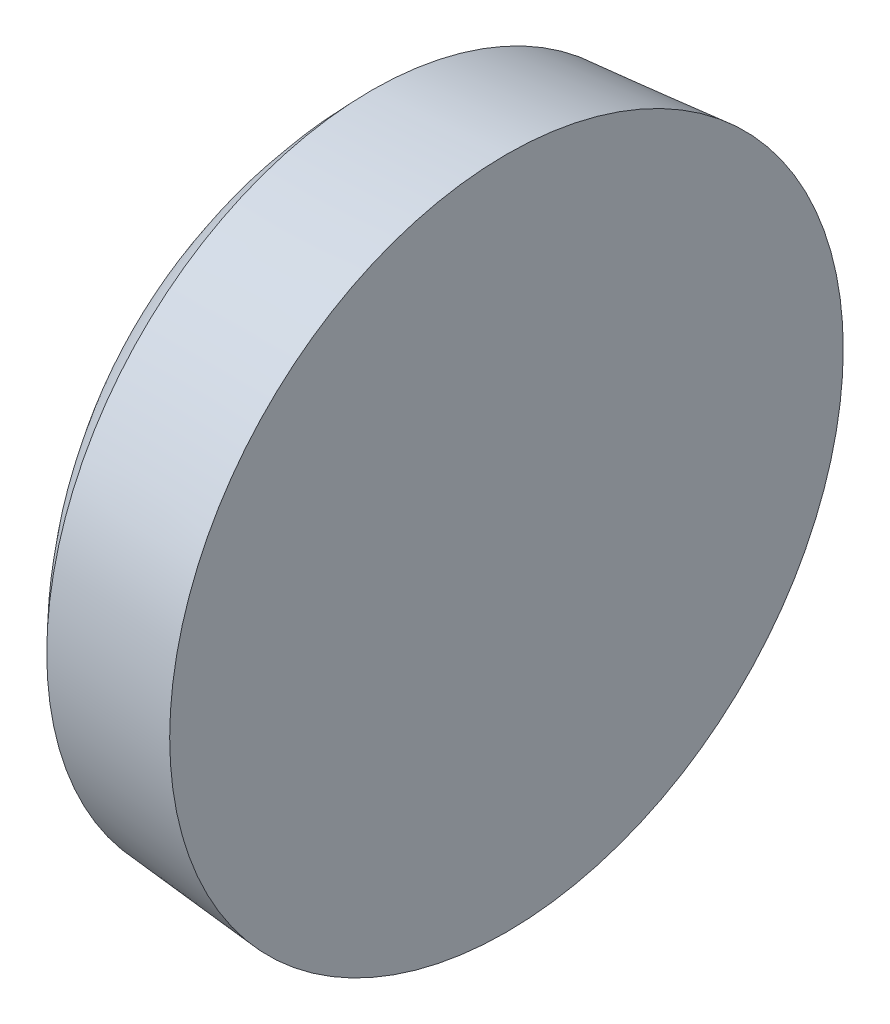
ISO-10303-21;
HEADER;
FILE_DESCRIPTION(('STEP AP214'),'2;1');
FILE_NAME('part.step','',(''),(''),'','','');
FILE_SCHEMA(('AUTOMOTIVE_DESIGN { 1 0 10303 214 1 1 1 1 }'));
ENDSEC;
DATA;
#1=APPLICATION_CONTEXT('core data for automotive mechanical design processes');
#2=APPLICATION_PROTOCOL_DEFINITION('international standard','automotive_design',2000,#1);
#3=PRODUCT_CONTEXT('',#1,'mechanical');
#4=PRODUCT('Part','Part','',(#3));
#5=PRODUCT_RELATED_PRODUCT_CATEGORY('part','',(#4));
#6=PRODUCT_DEFINITION_FORMATION('','',#4);
#7=PRODUCT_DEFINITION_CONTEXT('part definition',#1,'design');
#8=PRODUCT_DEFINITION('design','',#6,#7);
#9=PRODUCT_DEFINITION_SHAPE('','',#8);
#10=(LENGTH_UNIT() NAMED_UNIT(*) SI_UNIT(.MILLI.,.METRE.));
#11=(NAMED_UNIT(*) PLANE_ANGLE_UNIT() SI_UNIT($,.RADIAN.));
#12=(NAMED_UNIT(*) SI_UNIT($,.STERADIAN.) SOLID_ANGLE_UNIT());
#13=UNCERTAINTY_MEASURE_WITH_UNIT(LENGTH_MEASURE(1.E-05),#10,'distance_accuracy_value','');
#14=(GEOMETRIC_REPRESENTATION_CONTEXT(3) GLOBAL_UNCERTAINTY_ASSIGNED_CONTEXT((#13)) GLOBAL_UNIT_ASSIGNED_CONTEXT((#10,
#11,#12)) REPRESENTATION_CONTEXT('',''));
#15=CARTESIAN_POINT('',(0.,0.,0.));
#16=DIRECTION('',(0.,0.,1.));
#17=DIRECTION('',(1.,0.,0.));
#18=AXIS2_PLACEMENT_3D('',#15,#16,#17);
#19=CARTESIAN_POINT('',(60.9333333333333,-6.9,10.));
#20=DIRECTION('',(-1.,0.,0.));
#21=DIRECTION('',(0.,0.,1.));
#22=AXIS2_PLACEMENT_3D('',#19,#20,#21);
#23=PLANE('',#22);
#24=DIRECTION('',(0.,0.,-1.));
#25=VECTOR('',#24,1.);
#26=CARTESIAN_POINT('',(60.9333333333333,-5.95,10.));
#27=LINE('',#26,#25);
#28=CARTESIAN_POINT('',(60.9333333333333,-5.95,9.82));
#29=VERTEX_POINT('',#28);
#30=CARTESIAN_POINT('',(60.9333333333333,-5.95,10.18));
#31=VERTEX_POINT('',#30);
#32=EDGE_CURVE('E293',#29,#31,#27,.F.);
#33=ORIENTED_EDGE('',*,*,#32,.F.);
#34=DIRECTION('',(0.,1.,0.));
#35=VECTOR('',#34,1.);
#36=CARTESIAN_POINT('',(60.9333333333333,-6.9,9.82));
#37=LINE('',#36,#35);
#38=CARTESIAN_POINT('',(60.9333333333333,-6.72,9.82));
#39=VERTEX_POINT('',#38);
#40=EDGE_CURVE('E298',#39,#29,#37,.T.);
#41=ORIENTED_EDGE('',*,*,#40,.F.);
#42=DIRECTION('',(0.,0.,-1.));
#43=VECTOR('',#42,1.);
#44=CARTESIAN_POINT('',(60.9333333333333,-6.72,10.));
#45=LINE('',#44,#43);
#46=CARTESIAN_POINT('',(60.9333333333333,-6.72,9.05));
#47=VERTEX_POINT('',#46);
#48=EDGE_CURVE('E303',#47,#39,#45,.F.);
#49=ORIENTED_EDGE('',*,*,#48,.F.);
#50=DIRECTION('',(0.,1.,0.));
#51=VECTOR('',#50,1.);
#52=CARTESIAN_POINT('',(60.9333333333333,-6.9,9.05));
#53=LINE('',#52,#51);
#54=CARTESIAN_POINT('',(60.9333333333333,-7.08,9.05));
#55=VERTEX_POINT('',#54);
#56=EDGE_CURVE('E308',#55,#47,#53,.T.);
#57=ORIENTED_EDGE('',*,*,#56,.F.);
#58=DIRECTION('',(0.,0.,1.));
#59=VECTOR('',#58,1.);
#60=CARTESIAN_POINT('',(60.9333333333333,-7.08,10.));
#61=LINE('',#60,#59);
#62=CARTESIAN_POINT('',(60.9333333333333,-7.08,9.82));
#63=VERTEX_POINT('',#62);
#64=EDGE_CURVE('E313',#63,#55,#61,.F.);
#65=ORIENTED_EDGE('',*,*,#64,.F.);
#66=DIRECTION('',(0.,1.,0.));
#67=VECTOR('',#66,1.);
#68=CARTESIAN_POINT('',(60.9333333333333,-6.9,9.82));
#69=LINE('',#68,#67);
#70=CARTESIAN_POINT('',(60.9333333333333,-7.85,9.82));
#71=VERTEX_POINT('',#70);
#72=EDGE_CURVE('E318',#71,#63,#69,.T.);
#73=ORIENTED_EDGE('',*,*,#72,.F.);
#74=DIRECTION('',(0.,0.,-1.));
#75=VECTOR('',#74,1.);
#76=CARTESIAN_POINT('',(60.9333333333333,-7.85,10.));
#77=LINE('',#76,#75);
#78=CARTESIAN_POINT('',(60.9333333333333,-7.85,10.18));
#79=VERTEX_POINT('',#78);
#80=EDGE_CURVE('E267',#71,#79,#77,.F.);
#81=ORIENTED_EDGE('',*,*,#80,.T.);
#82=DIRECTION('',(0.,1.,0.));
#83=VECTOR('',#82,1.);
#84=CARTESIAN_POINT('',(60.9333333333333,-6.9,10.18));
#85=LINE('',#84,#83);
#86=CARTESIAN_POINT('',(60.9333333333333,-7.08,10.18));
#87=VERTEX_POINT('',#86);
#88=EDGE_CURVE('E264',#87,#79,#85,.F.);
#89=ORIENTED_EDGE('',*,*,#88,.F.);
#90=DIRECTION('',(0.,0.,1.));
#91=VECTOR('',#90,1.);
#92=CARTESIAN_POINT('',(60.9333333333333,-7.08,10.));
#93=LINE('',#92,#91);
#94=CARTESIAN_POINT('',(60.9333333333333,-7.08,10.95));
#95=VERTEX_POINT('',#94);
#96=EDGE_CURVE('E260',#95,#87,#93,.F.);
#97=ORIENTED_EDGE('',*,*,#96,.F.);
#98=DIRECTION('',(0.,1.,0.));
#99=VECTOR('',#98,1.);
#100=CARTESIAN_POINT('',(60.9333333333333,-6.9,10.95));
#101=LINE('',#100,#99);
#102=CARTESIAN_POINT('',(60.9333333333333,-6.72,10.95));
#103=VERTEX_POINT('',#102);
#104=EDGE_CURVE('E231',#95,#103,#101,.T.);
#105=ORIENTED_EDGE('',*,*,#104,.T.);
#106=DIRECTION('',(0.,0.,-1.));
#107=VECTOR('',#106,1.);
#108=CARTESIAN_POINT('',(60.9333333333333,-6.72,10.));
#109=LINE('',#108,#107);
#110=CARTESIAN_POINT('',(60.9333333333333,-6.72,10.18));
#111=VERTEX_POINT('',#110);
#112=EDGE_CURVE('E278',#111,#103,#109,.F.);
#113=ORIENTED_EDGE('',*,*,#112,.F.);
#114=DIRECTION('',(0.,1.,0.));
#115=VECTOR('',#114,1.);
#116=CARTESIAN_POINT('',(60.9333333333333,-6.9,10.18));
#117=LINE('',#116,#115);
#118=EDGE_CURVE('E288',#31,#111,#117,.F.);
#119=ORIENTED_EDGE('',*,*,#118,.F.);
#120=EDGE_LOOP('',(#33,#41,#49,#57,#65,#73,#81,#89,#97,#105,#113,#119));
#121=FACE_BOUND('',#120,.T.);
#122=ADVANCED_FACE('F17',(#121),#23,.T.);
#123=CARTESIAN_POINT('',(60.3333333333333,-7.08,10.));
#124=DIRECTION('',(0.,1.,0.));
#125=DIRECTION('',(0.,0.,1.));
#126=AXIS2_PLACEMENT_3D('',#123,#124,#125);
#127=PLANE('',#126);
#128=DIRECTION('',(1.,0.,0.));
#129=VECTOR('',#128,1.);
#130=CARTESIAN_POINT('',(60.3333333333333,-7.08,10.95));
#131=LINE('',#130,#129);
#132=CARTESIAN_POINT('',(59.9104288101423,-7.08,10.95));
#133=VERTEX_POINT('',#132);
#134=EDGE_CURVE('E89',#133,#95,#131,.T.);
#135=ORIENTED_EDGE('',*,*,#134,.T.);
#136=ORIENTED_EDGE('',*,*,#96,.T.);
#137=DIRECTION('',(-1.,0.,0.));
#138=VECTOR('',#137,1.);
#139=CARTESIAN_POINT('',(60.3333333333333,-7.08,10.18));
#140=LINE('',#139,#138);
#141=CARTESIAN_POINT('',(59.7452357635393,-7.08,10.18));
#142=VERTEX_POINT('',#141);
#143=EDGE_CURVE('E224',#142,#87,#140,.F.);
#144=ORIENTED_EDGE('',*,*,#143,.F.);
#145=CARTESIAN_POINT('',(59.9104288101423,-7.08,10.95));
#146=CARTESIAN_POINT('',(59.8988837959489,-7.08,10.9189995540506));
#147=CARTESIAN_POINT('',(59.8879044135648,-7.08,10.8877884938067));
#148=CARTESIAN_POINT('',(59.8671312150263,-7.08,10.8251104536469));
#149=CARTESIAN_POINT('',(59.857332908016,-7.08,10.7936449620741));
#150=CARTESIAN_POINT('',(59.8389093673758,-7.08,10.7304618501356));
#151=CARTESIAN_POINT('',(59.8302811277463,-7.08,10.6987451062672));
#152=CARTESIAN_POINT('',(59.8141893785797,-7.08,10.6350619663155));
#153=CARTESIAN_POINT('',(59.8067243497578,-7.08,10.6030959541242));
#154=CARTESIAN_POINT('',(59.7929551713712,-7.08,10.5389148788568));
#155=CARTESIAN_POINT('',(59.7866510218065,-7.08,10.5066998157808));
#156=CARTESIAN_POINT('',(59.7752042744412,-7.08,10.4420201537524));
#157=CARTESIAN_POINT('',(59.7700632196961,-7.08,10.4095552817086));
#158=CARTESIAN_POINT('',(59.7609481710222,-7.08,10.3443751591893));
#159=CARTESIAN_POINT('',(59.7569772780941,-7.08,10.3116594750372));
#160=CARTESIAN_POINT('',(59.7502122911846,-7.08,10.2459761632456));
#161=CARTESIAN_POINT('',(59.747422903366,-7.08,10.2130080508538));
#162=CARTESIAN_POINT('',(59.7452357635393,-7.08,10.18));
#163=B_SPLINE_CURVE_WITH_KNOTS('',3,(#145,#146,#147,#148,#149,#150,#151,#152,#153,#154,#155,
#156,#157,#158,#159,#160,#161,#162),.UNSPECIFIED.,.F.,.F.,(4,2,2,2,2,2,2,2,4),(0.,
0.0992357442434227,0.198081387639274,0.296668072480503,0.395124892694106,0.493581712907709,
0.592168397748937,0.691014041144793,0.790249785388213),.UNSPECIFIED.);
#164=EDGE_CURVE('E20',#133,#142,#163,.T.);
#165=ORIENTED_EDGE('',*,*,#164,.F.);
#166=EDGE_LOOP('',(#135,#136,#144,#165));
#167=FACE_BOUND('',#166,.T.);
#168=ADVANCED_FACE('F221',(#167),#127,.T.);
#169=CARTESIAN_POINT('',(60.3333333333333,-6.9,10.18));
#170=DIRECTION('',(0.,0.,-1.));
#171=DIRECTION('',(-1.,0.,0.));
#172=AXIS2_PLACEMENT_3D('',#169,#170,#171);
#173=PLANE('',#172);
#174=ORIENTED_EDGE('',*,*,#88,.T.);
#175=DIRECTION('',(1.,0.,0.));
#176=VECTOR('',#175,1.);
#177=CARTESIAN_POINT('',(60.3333333333333,-7.85,10.18));
#178=LINE('',#177,#176);
#179=CARTESIAN_POINT('',(59.9104288101423,-7.85,10.18));
#180=VERTEX_POINT('',#179);
#181=EDGE_CURVE('E324',#79,#180,#178,.F.);
#182=ORIENTED_EDGE('',*,*,#181,.T.);
#183=CARTESIAN_POINT('',(59.7452357635393,-7.08,10.18));
#184=CARTESIAN_POINT('',(59.7508899422282,-7.16559008255582,10.18));
#185=CARTESIAN_POINT('',(59.7606214296282,-7.25090347737769,10.18));
#186=CARTESIAN_POINT('',(59.7879885471447,-7.41965906159768,10.18));
#187=CARTESIAN_POINT('',(59.8055701011838,-7.50311001948195,10.18));
#188=CARTESIAN_POINT('',(59.8502992307462,-7.67504249159045,10.18));
#189=CARTESIAN_POINT('',(59.8781352938419,-7.76334531100346,10.18));
#190=CARTESIAN_POINT('',(59.9104288101423,-7.85000000000001,10.18));
#191=B_SPLINE_CURVE_WITH_KNOTS('',3,(#183,#184,#185,#186,#187,#188,#189,#190),.UNSPECIFIED.,.F.,
.F.,(4,2,2,4),(0.,0.257221658829339,0.512698117737348,0.789983486231617),.UNSPECIFIED.);
#192=EDGE_CURVE('E213',#142,#180,#191,.T.);
#193=ORIENTED_EDGE('',*,*,#192,.F.);
#194=ORIENTED_EDGE('',*,*,#143,.T.);
#195=EDGE_LOOP('',(#174,#182,#193,#194));
#196=FACE_BOUND('',#195,.T.);
#197=ADVANCED_FACE('F204',(#196),#173,.T.);
#198=CARTESIAN_POINT('',(60.3333333333333,-7.85,10.));
#199=DIRECTION('',(0.,-1.,0.));
#200=DIRECTION('',(0.,0.,-1.));
#201=AXIS2_PLACEMENT_3D('',#198,#199,#200);
#202=PLANE('',#201);
#203=ORIENTED_EDGE('',*,*,#181,.F.);
#204=ORIENTED_EDGE('',*,*,#80,.F.);
#205=DIRECTION('',(1.,0.,0.));
#206=VECTOR('',#205,1.);
#207=CARTESIAN_POINT('',(60.3333333333333,-7.85,9.82));
#208=LINE('',#207,#206);
#209=CARTESIAN_POINT('',(59.9104288101423,-7.85000000000001,9.82));
#210=VERTEX_POINT('',#209);
#211=EDGE_CURVE('E320',#210,#71,#208,.T.);
#212=ORIENTED_EDGE('',*,*,#211,.F.);
#213=CARTESIAN_POINT('',(59.9104288101423,-7.85,10.18));
#214=CARTESIAN_POINT('',(59.9062004144439,-7.85000000000002,10.12));
#215=CARTESIAN_POINT('',(59.9040862165948,-7.85000000000002,10.06));
#216=CARTESIAN_POINT('',(59.9040862165948,-7.84999999999998,9.93999999999996));
#217=CARTESIAN_POINT('',(59.9062004144439,-7.84999999999994,9.87999999999995));
#218=CARTESIAN_POINT('',(59.9104288101422,-7.84999999999989,9.81999999999994));
#219=B_SPLINE_CURVE_WITH_KNOTS('',3,(#213,#214,#215,#216,#217,#218),.UNSPECIFIED.,.F.,.F.,(4,2,
4),(0.,0.18011171114872,0.360223422297439),.UNSPECIFIED.);
#220=EDGE_CURVE('E207',#180,#210,#219,.T.);
#221=ORIENTED_EDGE('',*,*,#220,.F.);
#222=EDGE_LOOP('',(#203,#204,#212,#221));
#223=FACE_BOUND('',#222,.T.);
#224=ADVANCED_FACE('F199',(#223),#202,.F.);
#225=CARTESIAN_POINT('',(60.3333333333333,-6.9,9.82));
#226=DIRECTION('',(0.,0.,1.));
#227=DIRECTION('',(1.,0.,0.));
#228=AXIS2_PLACEMENT_3D('',#225,#226,#227);
#229=PLANE('',#228);
#230=ORIENTED_EDGE('',*,*,#72,.T.);
#231=DIRECTION('',(1.,0.,0.));
#232=VECTOR('',#231,1.);
#233=CARTESIAN_POINT('',(60.3333333333333,-7.08,9.82));
#234=LINE('',#233,#232);
#235=CARTESIAN_POINT('',(59.7452357635393,-7.08,9.82));
#236=VERTEX_POINT('',#235);
#237=EDGE_CURVE('E315',#236,#63,#234,.T.);
#238=ORIENTED_EDGE('',*,*,#237,.F.);
#239=CARTESIAN_POINT('',(59.9104288101423,-7.85000000000001,9.82));
#240=CARTESIAN_POINT('',(59.8988837959489,-7.81899955405059,9.82));
#241=CARTESIAN_POINT('',(59.8879044135648,-7.78778849380673,9.82));
#242=CARTESIAN_POINT('',(59.8671312150263,-7.72511045364685,9.82));
#243=CARTESIAN_POINT('',(59.857332908016,-7.69364496207406,9.82));
#244=CARTESIAN_POINT('',(59.8389093673758,-7.6304618501356,9.82));
#245=CARTESIAN_POINT('',(59.8302811277463,-7.59874510626724,9.82));
#246=CARTESIAN_POINT('',(59.8141893785797,-7.5350619663155,9.82));
#247=CARTESIAN_POINT('',(59.8067243497578,-7.50309595412419,9.82));
#248=CARTESIAN_POINT('',(59.7929551713712,-7.43891487885683,9.82));
#249=CARTESIAN_POINT('',(59.7866510218065,-7.4066998157808,9.82));
#250=CARTESIAN_POINT('',(59.7752042744412,-7.34202015375239,9.82));
#251=CARTESIAN_POINT('',(59.7700632196961,-7.30955528170857,9.82));
#252=CARTESIAN_POINT('',(59.7609481710222,-7.24437515918932,9.82));
#253=CARTESIAN_POINT('',(59.7569772780941,-7.21165947503723,9.82));
#254=CARTESIAN_POINT('',(59.7502122911846,-7.1459761632456,9.82));
#255=CARTESIAN_POINT('',(59.747422903366,-7.11300805085378,9.82));
#256=CARTESIAN_POINT('',(59.7452357635393,-7.08,9.82));
#257=B_SPLINE_CURVE_WITH_KNOTS('',3,(#239,#240,#241,#242,#243,#244,#245,#246,#247,#248,#249,
#250,#251,#252,#253,#254,#255,#256),.UNSPECIFIED.,.F.,.F.,(4,2,2,2,2,2,2,2,4),(0.,
0.099235744243422,0.198081387639272,0.296668072480501,0.395124892694104,0.493581712907706,
0.592168397748932,0.691014041144787,0.790249785388207),.UNSPECIFIED.);
#258=EDGE_CURVE('E184',#210,#236,#257,.T.);
#259=ORIENTED_EDGE('',*,*,#258,.F.);
#260=ORIENTED_EDGE('',*,*,#211,.T.);
#261=EDGE_LOOP('',(#230,#238,#259,#260));
#262=FACE_BOUND('',#261,.T.);
#263=ADVANCED_FACE('F194',(#262),#229,.T.);
#264=CARTESIAN_POINT('',(60.3333333333333,-7.08,10.));
#265=DIRECTION('',(0.,1.,0.));
#266=DIRECTION('',(0.,0.,1.));
#267=AXIS2_PLACEMENT_3D('',#264,#265,#266);
#268=PLANE('',#267);
#269=DIRECTION('',(1.,0.,0.));
#270=VECTOR('',#269,1.);
#271=CARTESIAN_POINT('',(60.3333333333333,-7.08,9.05));
#272=LINE('',#271,#270);
#273=CARTESIAN_POINT('',(59.9104288101423,-7.08,9.05));
#274=VERTEX_POINT('',#273);
#275=EDGE_CURVE('E310',#274,#55,#272,.T.);
#276=ORIENTED_EDGE('',*,*,#275,.F.);
#277=CARTESIAN_POINT('',(59.7452357635393,-7.08,9.82));
#278=CARTESIAN_POINT('',(59.7508899422282,-7.08,9.73440991744419));
#279=CARTESIAN_POINT('',(59.7606214296282,-7.08,9.64909652262232));
#280=CARTESIAN_POINT('',(59.7879885471447,-7.08,9.48034093840232));
#281=CARTESIAN_POINT('',(59.8055701011838,-7.08,9.39688998051806));
#282=CARTESIAN_POINT('',(59.8502992307462,-7.08,9.22495750840955));
#283=CARTESIAN_POINT('',(59.8781352938419,-7.08,9.13665468899654));
#284=CARTESIAN_POINT('',(59.9104288101423,-7.08,9.04999999999999));
#285=B_SPLINE_CURVE_WITH_KNOTS('',3,(#277,#278,#279,#280,#281,#282,#283,#284),.UNSPECIFIED.,.F.,
.F.,(4,2,2,4),(0.,0.257221658829336,0.512698117737347,0.789983486231627),.UNSPECIFIED.);
#286=EDGE_CURVE('E176',#236,#274,#285,.T.);
#287=ORIENTED_EDGE('',*,*,#286,.F.);
#288=ORIENTED_EDGE('',*,*,#237,.T.);
#289=ORIENTED_EDGE('',*,*,#64,.T.);
#290=EDGE_LOOP('',(#276,#287,#288,#289));
#291=FACE_BOUND('',#290,.T.);
#292=ADVANCED_FACE('F191',(#291),#268,.T.);
#293=CARTESIAN_POINT('',(60.3333333333333,-6.9,9.05));
#294=DIRECTION('',(0.,0.,1.));
#295=DIRECTION('',(1.,0.,0.));
#296=AXIS2_PLACEMENT_3D('',#293,#294,#295);
#297=PLANE('',#296);
#298=DIRECTION('',(1.,0.,0.));
#299=VECTOR('',#298,1.);
#300=CARTESIAN_POINT('',(60.3333333333333,-6.72,9.05));
#301=LINE('',#300,#299);
#302=CARTESIAN_POINT('',(59.9104288101423,-6.72,9.05));
#303=VERTEX_POINT('',#302);
#304=EDGE_CURVE('E305',#303,#47,#301,.T.);
#305=ORIENTED_EDGE('',*,*,#304,.F.);
#306=CARTESIAN_POINT('',(59.9104288101423,-6.72,9.05));
#307=CARTESIAN_POINT('',(59.9040862165948,-6.80988825418623,9.05));
#308=CARTESIAN_POINT('',(59.9040862165948,-6.9,9.05));
#309=B_SPLINE_CURVE_WITH_KNOTS('',2,(#306,#307,#308),.UNSPECIFIED.,.F.,.F.,(3,3),(0.,1.),.UNSPECIFIED.);
#310=CARTESIAN_POINT('',(59.9040862165948,-6.9,9.05));
#311=VERTEX_POINT('',#310);
#312=EDGE_CURVE('E175',#311,#303,#309,.F.);
#313=ORIENTED_EDGE('',*,*,#312,.F.);
#314=CARTESIAN_POINT('',(59.9040862165948,-6.9,9.05));
#315=CARTESIAN_POINT('',(59.9040862165948,-6.99011174581378,9.05));
#316=CARTESIAN_POINT('',(59.9104288101423,-7.08,9.05));
#317=B_SPLINE_CURVE_WITH_KNOTS('',2,(#314,#315,#316),.UNSPECIFIED.,.F.,.F.,(3,3),(0.,1.),.UNSPECIFIED.);
#318=EDGE_CURVE('E183',#274,#311,#317,.F.);
#319=ORIENTED_EDGE('',*,*,#318,.F.);
#320=ORIENTED_EDGE('',*,*,#275,.T.);
#321=ORIENTED_EDGE('',*,*,#56,.T.);
#322=EDGE_LOOP('',(#305,#313,#319,#320,#321));
#323=FACE_BOUND('',#322,.T.);
#324=ADVANCED_FACE('F164',(#323),#297,.T.);
#325=CARTESIAN_POINT('',(60.3333333333333,-6.72,10.));
#326=DIRECTION('',(0.,-1.,0.));
#327=DIRECTION('',(0.,0.,-1.));
#328=AXIS2_PLACEMENT_3D('',#325,#326,#327);
#329=PLANE('',#328);
#330=ORIENTED_EDGE('',*,*,#304,.T.);
#331=ORIENTED_EDGE('',*,*,#48,.T.);
#332=DIRECTION('',(1.,0.,0.));
#333=VECTOR('',#332,1.);
#334=CARTESIAN_POINT('',(60.3333333333333,-6.72,9.82));
#335=LINE('',#334,#333);
#336=CARTESIAN_POINT('',(59.7452357635393,-6.72,9.82));
#337=VERTEX_POINT('',#336);
#338=EDGE_CURVE('E300',#337,#39,#335,.T.);
#339=ORIENTED_EDGE('',*,*,#338,.F.);
#340=CARTESIAN_POINT('',(59.9104288101423,-6.72,9.04999999999999));
#341=CARTESIAN_POINT('',(59.8988837959489,-6.72,9.08100044594941));
#342=CARTESIAN_POINT('',(59.8879044135648,-6.72,9.11221150619327));
#343=CARTESIAN_POINT('',(59.8671312150263,-6.72,9.17488954635315));
#344=CARTESIAN_POINT('',(59.857332908016,-6.72,9.20635503792595));
#345=CARTESIAN_POINT('',(59.8389093673758,-6.72,9.2695381498644));
#346=CARTESIAN_POINT('',(59.8302811277463,-6.72,9.30125489373276));
#347=CARTESIAN_POINT('',(59.8141893785797,-6.72,9.3649380336845));
#348=CARTESIAN_POINT('',(59.8067243497578,-6.72,9.39690404587582));
#349=CARTESIAN_POINT('',(59.7929551713712,-6.72,9.46108512114317));
#350=CARTESIAN_POINT('',(59.7866510218065,-6.72,9.4933001842192));
#351=CARTESIAN_POINT('',(59.7752042744412,-6.72,9.55797984624761));
#352=CARTESIAN_POINT('',(59.7700632196961,-6.72,9.59044471829143));
#353=CARTESIAN_POINT('',(59.7609481710222,-6.72,9.65562484081068));
#354=CARTESIAN_POINT('',(59.7569772780942,-6.72,9.68834052496277));
#355=CARTESIAN_POINT('',(59.7502122911846,-6.72,9.7540238367544));
#356=CARTESIAN_POINT('',(59.747422903366,-6.72,9.78699194914622));
#357=CARTESIAN_POINT('',(59.7452357635393,-6.72,9.82));
#358=B_SPLINE_CURVE_WITH_KNOTS('',3,(#340,#341,#342,#343,#344,#345,#346,#347,#348,#349,#350,
#351,#352,#353,#354,#355,#356,#357),.UNSPECIFIED.,.F.,.F.,(4,2,2,2,2,2,2,2,4),(0.,
0.099235744243422,0.198081387639272,0.2966680724805,0.395124892694104,0.493581712907706,
0.592168397748934,0.691014041144787,0.790249785388206),.UNSPECIFIED.);
#359=EDGE_CURVE('E168',#303,#337,#358,.T.);
#360=ORIENTED_EDGE('',*,*,#359,.F.);
#361=EDGE_LOOP('',(#330,#331,#339,#360));
#362=FACE_BOUND('',#361,.T.);
#363=ADVANCED_FACE('F159',(#362),#329,.T.);
#364=CARTESIAN_POINT('',(60.3333333333333,-6.9,9.82));
#365=DIRECTION('',(0.,0.,1.));
#366=DIRECTION('',(1.,0.,0.));
#367=AXIS2_PLACEMENT_3D('',#364,#365,#366);
#368=PLANE('',#367);
#369=ORIENTED_EDGE('',*,*,#40,.T.);
#370=DIRECTION('',(1.,0.,0.));
#371=VECTOR('',#370,1.);
#372=CARTESIAN_POINT('',(60.3333333333333,-5.95,9.82));
#373=LINE('',#372,#371);
#374=CARTESIAN_POINT('',(59.9104288101423,-5.95,9.82));
#375=VERTEX_POINT('',#374);
#376=EDGE_CURVE('E295',#375,#29,#373,.T.);
#377=ORIENTED_EDGE('',*,*,#376,.F.);
#378=CARTESIAN_POINT('',(59.7452357635393,-6.72,9.82));
#379=CARTESIAN_POINT('',(59.7508899422282,-6.63440991744419,9.82));
#380=CARTESIAN_POINT('',(59.7606214296282,-6.54909652262232,9.82));
#381=CARTESIAN_POINT('',(59.7879885471447,-6.38034093840232,9.82));
#382=CARTESIAN_POINT('',(59.8055701011838,-6.29688998051805,9.82));
#383=CARTESIAN_POINT('',(59.8502992307462,-6.12495750840955,9.82));
#384=CARTESIAN_POINT('',(59.8781352938419,-6.03665468899654,9.82));
#385=CARTESIAN_POINT('',(59.9104288101423,-5.94999999999999,9.82));
#386=B_SPLINE_CURVE_WITH_KNOTS('',3,(#378,#379,#380,#381,#382,#383,#384,#385),.UNSPECIFIED.,.F.,
.F.,(4,2,2,4),(0.,0.257221658829338,0.512698117737348,0.789983486231624),.UNSPECIFIED.);
#387=EDGE_CURVE('E144',#337,#375,#386,.T.);
#388=ORIENTED_EDGE('',*,*,#387,.F.);
#389=ORIENTED_EDGE('',*,*,#338,.T.);
#390=EDGE_LOOP('',(#369,#377,#388,#389));
#391=FACE_BOUND('',#390,.T.);
#392=ADVANCED_FACE('F154',(#391),#368,.T.);
#393=CARTESIAN_POINT('',(60.3333333333333,-5.95,10.));
#394=DIRECTION('',(0.,-1.,0.));
#395=DIRECTION('',(0.,0.,-1.));
#396=AXIS2_PLACEMENT_3D('',#393,#394,#395);
#397=PLANE('',#396);
#398=ORIENTED_EDGE('',*,*,#32,.T.);
#399=DIRECTION('',(-1.,0.,0.));
#400=VECTOR('',#399,1.);
#401=CARTESIAN_POINT('',(60.3333333333333,-5.95,10.18));
#402=LINE('',#401,#400);
#403=CARTESIAN_POINT('',(59.9104288101423,-5.94999999999999,10.18));
#404=VERTEX_POINT('',#403);
#405=EDGE_CURVE('E290',#404,#31,#402,.F.);
#406=ORIENTED_EDGE('',*,*,#405,.F.);
#407=CARTESIAN_POINT('',(59.9104288101423,-5.95,9.82));
#408=CARTESIAN_POINT('',(59.9062004144439,-5.94999999999999,9.88000000000001));
#409=CARTESIAN_POINT('',(59.9040862165948,-5.94999999999999,9.94000000000002));
#410=CARTESIAN_POINT('',(59.9040862165948,-5.95000000000001,10.06));
#411=CARTESIAN_POINT('',(59.9062004144439,-5.95000000000003,10.1200000000001));
#412=CARTESIAN_POINT('',(59.9104288101423,-5.95000000000006,10.1800000000001));
#413=B_SPLINE_CURVE_WITH_KNOTS('',3,(#407,#408,#409,#410,#411,#412),.UNSPECIFIED.,.F.,.F.,(4,2,
4),(0.,0.18011171114872,0.360223422297442),.UNSPECIFIED.);
#414=EDGE_CURVE('E137',#375,#404,#413,.T.);
#415=ORIENTED_EDGE('',*,*,#414,.F.);
#416=ORIENTED_EDGE('',*,*,#376,.T.);
#417=EDGE_LOOP('',(#398,#406,#415,#416));
#418=FACE_BOUND('',#417,.T.);
#419=ADVANCED_FACE('F151',(#418),#397,.T.);
#420=CARTESIAN_POINT('',(60.3333333333333,-6.9,10.18));
#421=DIRECTION('',(0.,0.,-1.));
#422=DIRECTION('',(-1.,0.,0.));
#423=AXIS2_PLACEMENT_3D('',#420,#421,#422);
#424=PLANE('',#423);
#425=ORIENTED_EDGE('',*,*,#118,.T.);
#426=DIRECTION('',(1.,0.,0.));
#427=VECTOR('',#426,1.);
#428=CARTESIAN_POINT('',(60.3333333333333,-6.72,10.18));
#429=LINE('',#428,#427);
#430=CARTESIAN_POINT('',(59.7452357635393,-6.72,10.18));
#431=VERTEX_POINT('',#430);
#432=EDGE_CURVE('E280',#431,#111,#429,.T.);
#433=ORIENTED_EDGE('',*,*,#432,.F.);
#434=CARTESIAN_POINT('',(59.9104288101423,-5.94999999999999,10.18));
#435=CARTESIAN_POINT('',(59.8988837959489,-5.98100044594941,10.18));
#436=CARTESIAN_POINT('',(59.8879044135648,-6.01221150619326,10.18));
#437=CARTESIAN_POINT('',(59.8671312150263,-6.07488954635315,10.18));
#438=CARTESIAN_POINT('',(59.857332908016,-6.10635503792594,10.18));
#439=CARTESIAN_POINT('',(59.8389093673758,-6.1695381498644,10.18));
#440=CARTESIAN_POINT('',(59.8302811277463,-6.20125489373276,10.18));
#441=CARTESIAN_POINT('',(59.8141893785797,-6.2649380336845,10.18));
#442=CARTESIAN_POINT('',(59.8067243497578,-6.29690404587582,10.18));
#443=CARTESIAN_POINT('',(59.7929551713712,-6.36108512114317,10.18));
#444=CARTESIAN_POINT('',(59.7866510218065,-6.39330018421921,10.18));
#445=CARTESIAN_POINT('',(59.7752042744412,-6.45797984624761,10.18));
#446=CARTESIAN_POINT('',(59.7700632196961,-6.49044471829143,10.18));
#447=CARTESIAN_POINT('',(59.7609481710222,-6.55562484081068,10.18));
#448=CARTESIAN_POINT('',(59.7569772780941,-6.58834052496277,10.18));
#449=CARTESIAN_POINT('',(59.7502122911846,-6.6540238367544,10.18));
#450=CARTESIAN_POINT('',(59.747422903366,-6.68699194914622,10.18));
#451=CARTESIAN_POINT('',(59.7452357635393,-6.72,10.18));
#452=B_SPLINE_CURVE_WITH_KNOTS('',3,(#434,#435,#436,#437,#438,#439,#440,#441,#442,#443,#444,
#445,#446,#447,#448,#449,#450,#451),.UNSPECIFIED.,.F.,.F.,(4,2,2,2,2,2,2,2,4),(0.,
0.0992357442434227,0.198081387639276,0.296668072480504,0.395124892694107,0.493581712907709,
0.592168397748936,0.691014041144789,0.79024978538821),.UNSPECIFIED.);
#453=EDGE_CURVE('E100',#404,#431,#452,.T.);
#454=ORIENTED_EDGE('',*,*,#453,.F.);
#455=ORIENTED_EDGE('',*,*,#405,.T.);
#456=EDGE_LOOP('',(#425,#433,#454,#455));
#457=FACE_BOUND('',#456,.T.);
#458=ADVANCED_FACE('F123',(#457),#424,.T.);
#459=CARTESIAN_POINT('',(60.3333333333333,-6.72,10.));
#460=DIRECTION('',(0.,-1.,0.));
#461=DIRECTION('',(0.,0.,-1.));
#462=AXIS2_PLACEMENT_3D('',#459,#460,#461);
#463=PLANE('',#462);
#464=DIRECTION('',(1.,0.,0.));
#465=VECTOR('',#464,1.);
#466=CARTESIAN_POINT('',(60.3333333333333,-6.72,10.95));
#467=LINE('',#466,#465);
#468=CARTESIAN_POINT('',(59.9104288101423,-6.72,10.95));
#469=VERTEX_POINT('',#468);
#470=EDGE_CURVE('E40',#103,#469,#467,.F.);
#471=ORIENTED_EDGE('',*,*,#470,.T.);
#472=CARTESIAN_POINT('',(59.7452357635393,-6.72,10.18));
#473=CARTESIAN_POINT('',(59.7508899422282,-6.72,10.2655900825558));
#474=CARTESIAN_POINT('',(59.7606214296282,-6.72,10.3509034773777));
#475=CARTESIAN_POINT('',(59.7879885471447,-6.72,10.5196590615977));
#476=CARTESIAN_POINT('',(59.8055701011838,-6.72,10.6031100194819));
#477=CARTESIAN_POINT('',(59.8502992307462,-6.72,10.7750424915905));
#478=CARTESIAN_POINT('',(59.8781352938419,-6.72,10.8633453110035));
#479=CARTESIAN_POINT('',(59.9104288101423,-6.72,10.95));
#480=B_SPLINE_CURVE_WITH_KNOTS('',3,(#472,#473,#474,#475,#476,#477,#478,#479),.UNSPECIFIED.,.F.,
.F.,(4,2,2,4),(0.,0.25722165882934,0.51269811773735,0.789983486231623),.UNSPECIFIED.);
#481=EDGE_CURVE('E96',#431,#469,#480,.T.);
#482=ORIENTED_EDGE('',*,*,#481,.F.);
#483=ORIENTED_EDGE('',*,*,#432,.T.);
#484=ORIENTED_EDGE('',*,*,#112,.T.);
#485=EDGE_LOOP('',(#471,#482,#483,#484));
#486=FACE_BOUND('',#485,.T.);
#487=ADVANCED_FACE('F115',(#486),#463,.T.);
#488=CARTESIAN_POINT('',(60.3333333333333,-6.9,10.95));
#489=DIRECTION('',(0.,0.,1.));
#490=DIRECTION('',(1.,0.,0.));
#491=AXIS2_PLACEMENT_3D('',#488,#489,#490);
#492=PLANE('',#491);
#493=ORIENTED_EDGE('',*,*,#470,.F.);
#494=ORIENTED_EDGE('',*,*,#104,.F.);
#495=ORIENTED_EDGE('',*,*,#134,.F.);
#496=CARTESIAN_POINT('',(59.9040862165948,-6.9,10.95));
#497=CARTESIAN_POINT('',(59.9040862165948,-6.99011174581378,10.95));
#498=CARTESIAN_POINT('',(59.9104288101423,-7.08,10.95));
#499=B_SPLINE_CURVE_WITH_KNOTS('',2,(#496,#497,#498),.UNSPECIFIED.,.F.,.F.,(3,3),(0.,1.),.UNSPECIFIED.);
#500=CARTESIAN_POINT('',(59.9040862165948,-6.9,10.95));
#501=VERTEX_POINT('',#500);
#502=EDGE_CURVE('E82',#501,#133,#499,.T.);
#503=ORIENTED_EDGE('',*,*,#502,.F.);
#504=CARTESIAN_POINT('',(59.9104288101423,-6.72,10.95));
#505=CARTESIAN_POINT('',(59.9040862165948,-6.80988825418623,10.95));
#506=CARTESIAN_POINT('',(59.9040862165948,-6.9,10.95));
#507=B_SPLINE_CURVE_WITH_KNOTS('',2,(#504,#505,#506),.UNSPECIFIED.,.F.,.F.,(3,3),(0.,1.),.UNSPECIFIED.);
#508=EDGE_CURVE('E85',#469,#501,#507,.T.);
#509=ORIENTED_EDGE('',*,*,#508,.F.);
#510=EDGE_LOOP('',(#493,#494,#495,#503,#509));
#511=FACE_BOUND('',#510,.T.);
#512=ADVANCED_FACE('F84',(#511),#492,.F.);
#513=CARTESIAN_POINT('',(62.4614177127797,-6.9,10.));
#514=DIRECTION('',(1.,0.,0.));
#515=DIRECTION('',(0.,1.,0.));
#516=AXIS2_PLACEMENT_3D('',#513,#514,#515);
#517=SPHERICAL_SURFACE('',#516,2.72808437944638);
#518=CARTESIAN_POINT('',(60.5333333333533,-6.9,10.));
#519=DIRECTION('',(1.,0.,0.));
#520=DIRECTION('',(0.,0.,1.));
#521=AXIS2_PLACEMENT_3D('',#518,#519,#520);
#522=CIRCLE('',#521,1.93000906918229);
#523=CARTESIAN_POINT('',(60.5333333333533,-6.89999999999993,11.9300090691823));
#524=VERTEX_POINT('',#523);
#525=EDGE_CURVE('E31',#524,#524,#522,.T.);
#526=ORIENTED_EDGE('',*,*,#525,.F.);
#527=EDGE_LOOP('',(#526));
#528=FACE_BOUND('',#527,.T.);
#529=ORIENTED_EDGE('',*,*,#481,.T.);
#530=ORIENTED_EDGE('',*,*,#508,.T.);
#531=ORIENTED_EDGE('',*,*,#502,.T.);
#532=ORIENTED_EDGE('',*,*,#164,.T.);
#533=ORIENTED_EDGE('',*,*,#192,.T.);
#534=ORIENTED_EDGE('',*,*,#220,.T.);
#535=ORIENTED_EDGE('',*,*,#258,.T.);
#536=ORIENTED_EDGE('',*,*,#286,.T.);
#537=ORIENTED_EDGE('',*,*,#318,.T.);
#538=ORIENTED_EDGE('',*,*,#312,.T.);
#539=ORIENTED_EDGE('',*,*,#359,.T.);
#540=ORIENTED_EDGE('',*,*,#387,.T.);
#541=ORIENTED_EDGE('',*,*,#414,.T.);
#542=ORIENTED_EDGE('',*,*,#453,.T.);
#543=EDGE_LOOP('',(#529,#530,#531,#532,#533,#534,#535,#536,#537,#538,#539,#540,#541,#542));
#544=FACE_BOUND('',#543,.T.);
#545=ADVANCED_FACE('F94',(#528,#544),#517,.T.);
#546=CARTESIAN_POINT('',(61.3333333333799,-6.9,10.));
#547=DIRECTION('',(1.,0.,0.));
#548=DIRECTION('',(0.,1.,0.));
#549=AXIS2_PLACEMENT_3D('',#546,#547,#548);
#550=CONICAL_SURFACE('',#549,2.00000000000756,0.0872664626024547);
#551=CARTESIAN_POINT('',(61.333333333323,-6.9,10.));
#552=DIRECTION('',(1.,0.,0.));
#553=DIRECTION('',(0.,1.,0.));
#554=AXIS2_PLACEMENT_3D('',#551,#552,#553);
#555=CIRCLE('',#554,2.00000000000259);
#556=CARTESIAN_POINT('',(61.333333333323,-4.89999999999741,10.));
#557=VERTEX_POINT('',#556);
#558=EDGE_CURVE('E11',#557,#557,#555,.T.);
#559=ORIENTED_EDGE('',*,*,#558,.F.);
#560=EDGE_LOOP('',(#559));
#561=FACE_BOUND('',#560,.T.);
#562=ORIENTED_EDGE('',*,*,#525,.T.);
#563=EDGE_LOOP('',(#562));
#564=FACE_BOUND('',#563,.T.);
#565=ADVANCED_FACE('F402',(#561,#564),#550,.T.);
#566=CARTESIAN_POINT('',(61.3333333333333,-6.9,11.));
#567=DIRECTION('',(1.,0.,0.));
#568=DIRECTION('',(0.,0.,-1.));
#569=AXIS2_PLACEMENT_3D('',#566,#567,#568);
#570=PLANE('',#569);
#571=ORIENTED_EDGE('',*,*,#558,.T.);
#572=EDGE_LOOP('',(#571));
#573=FACE_BOUND('',#572,.T.);
#574=ADVANCED_FACE('F400',(#573),#570,.T.);
#575=CLOSED_SHELL('',(#122,#168,#197,#224,#263,#292,#324,#363,#392,#419,#458,#487,#512,#545,
#565,#574));
#576=MANIFOLD_SOLID_BREP('B1',#575);
#577=ADVANCED_BREP_SHAPE_REPRESENTATION('',(#18,#576),#14);
#578=SHAPE_DEFINITION_REPRESENTATION(#9,#577);
ENDSEC;
END-ISO-10303-21;
